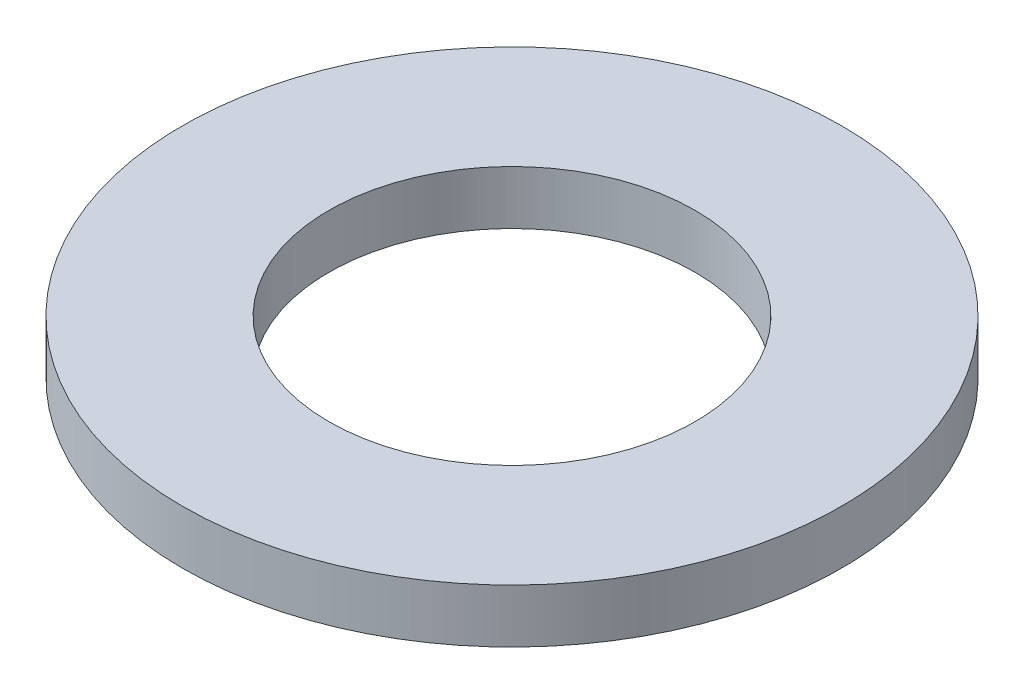
ISO-10303-21;
HEADER;
FILE_DESCRIPTION(('STEP AP214'),'2;1');
FILE_NAME('part.step','',(''),(''),'','','');
FILE_SCHEMA(('AUTOMOTIVE_DESIGN { 1 0 10303 214 1 1 1 1 }'));
ENDSEC;
DATA;
#1=APPLICATION_CONTEXT('core data for automotive mechanical design processes');
#2=APPLICATION_PROTOCOL_DEFINITION('international standard','automotive_design',2000,#1);
#3=PRODUCT_CONTEXT('',#1,'mechanical');
#4=PRODUCT('Part','Part','',(#3));
#5=PRODUCT_RELATED_PRODUCT_CATEGORY('part','',(#4));
#6=PRODUCT_DEFINITION_FORMATION('','',#4);
#7=PRODUCT_DEFINITION_CONTEXT('part definition',#1,'design');
#8=PRODUCT_DEFINITION('design','',#6,#7);
#9=PRODUCT_DEFINITION_SHAPE('','',#8);
#10=(LENGTH_UNIT() NAMED_UNIT(*) SI_UNIT(.MILLI.,.METRE.));
#11=(NAMED_UNIT(*) PLANE_ANGLE_UNIT() SI_UNIT($,.RADIAN.));
#12=(NAMED_UNIT(*) SI_UNIT($,.STERADIAN.) SOLID_ANGLE_UNIT());
#13=UNCERTAINTY_MEASURE_WITH_UNIT(LENGTH_MEASURE(1.E-05),#10,'distance_accuracy_value','');
#14=(GEOMETRIC_REPRESENTATION_CONTEXT(3) GLOBAL_UNCERTAINTY_ASSIGNED_CONTEXT((#13)) GLOBAL_UNIT_ASSIGNED_CONTEXT((#10,
#11,#12)) REPRESENTATION_CONTEXT('',''));
#15=CARTESIAN_POINT('',(0.,0.,0.));
#16=DIRECTION('',(0.,0.,1.));
#17=DIRECTION('',(1.,0.,0.));
#18=AXIS2_PLACEMENT_3D('',#15,#16,#17);
#19=CARTESIAN_POINT('',(0.,11.,0.));
#20=DIRECTION('',(0.,-1.,0.));
#21=DIRECTION('',(0.,0.,-1.));
#22=AXIS2_PLACEMENT_3D('',#19,#20,#21);
#23=CYLINDRICAL_SURFACE('',#22,67.5);
#24=CARTESIAN_POINT('',(0.,11.,0.));
#25=DIRECTION('',(0.,1.,0.));
#26=DIRECTION('',(0.,0.,1.));
#27=AXIS2_PLACEMENT_3D('',#24,#25,#26);
#28=CIRCLE('',#27,67.5);
#29=CARTESIAN_POINT('',(0.,11.,67.5));
#30=VERTEX_POINT('',#29);
#31=EDGE_CURVE('E10',#30,#30,#28,.T.);
#32=ORIENTED_EDGE('',*,*,#31,.F.);
#33=EDGE_LOOP('',(#32));
#34=FACE_BOUND('',#33,.T.);
#35=CARTESIAN_POINT('',(0.,0.,0.));
#36=DIRECTION('',(0.,1.,0.));
#37=DIRECTION('',(0.,0.,1.));
#38=AXIS2_PLACEMENT_3D('',#35,#36,#37);
#39=CIRCLE('',#38,67.5);
#40=CARTESIAN_POINT('',(0.,0.,67.5));
#41=VERTEX_POINT('',#40);
#42=EDGE_CURVE('E37',#41,#41,#39,.T.);
#43=ORIENTED_EDGE('',*,*,#42,.T.);
#44=EDGE_LOOP('',(#43));
#45=FACE_BOUND('',#44,.T.);
#46=ADVANCED_FACE('F40',(#34,#45),#23,.T.);
#47=CARTESIAN_POINT('',(0.,11.,0.));
#48=DIRECTION('',(0.,1.,0.));
#49=DIRECTION('',(0.,0.,1.));
#50=AXIS2_PLACEMENT_3D('',#47,#48,#49);
#51=PLANE('',#50);
#52=CARTESIAN_POINT('',(0.,11.,0.));
#53=DIRECTION('',(0.,1.,0.));
#54=DIRECTION('',(0.,0.,1.));
#55=AXIS2_PLACEMENT_3D('',#52,#53,#54);
#56=CIRCLE('',#55,37.5);
#57=CARTESIAN_POINT('',(0.,11.,37.5));
#58=VERTEX_POINT('',#57);
#59=EDGE_CURVE('E50',#58,#58,#56,.T.);
#60=ORIENTED_EDGE('',*,*,#59,.F.);
#61=EDGE_LOOP('',(#60));
#62=FACE_BOUND('',#61,.T.);
#63=ORIENTED_EDGE('',*,*,#31,.T.);
#64=EDGE_LOOP('',(#63));
#65=FACE_BOUND('',#64,.T.);
#66=ADVANCED_FACE('F59',(#62,#65),#51,.T.);
#67=CARTESIAN_POINT('',(0.,0.,0.));
#68=DIRECTION('',(0.,1.,0.));
#69=DIRECTION('',(0.,0.,1.));
#70=AXIS2_PLACEMENT_3D('',#67,#68,#69);
#71=PLANE('',#70);
#72=CARTESIAN_POINT('',(0.,0.,0.));
#73=DIRECTION('',(0.,1.,0.));
#74=DIRECTION('',(0.,0.,1.));
#75=AXIS2_PLACEMENT_3D('',#72,#73,#74);
#76=CIRCLE('',#75,37.5);
#77=CARTESIAN_POINT('',(0.,0.,37.5));
#78=VERTEX_POINT('',#77);
#79=EDGE_CURVE('E47',#78,#78,#76,.T.);
#80=ORIENTED_EDGE('',*,*,#79,.T.);
#81=EDGE_LOOP('',(#80));
#82=FACE_BOUND('',#81,.T.);
#83=ORIENTED_EDGE('',*,*,#42,.F.);
#84=EDGE_LOOP('',(#83));
#85=FACE_BOUND('',#84,.T.);
#86=ADVANCED_FACE('F58',(#82,#85),#71,.F.);
#87=CARTESIAN_POINT('',(0.,11.,0.));
#88=DIRECTION('',(0.,-1.,0.));
#89=DIRECTION('',(0.,0.,-1.));
#90=AXIS2_PLACEMENT_3D('',#87,#88,#89);
#91=CYLINDRICAL_SURFACE('',#90,37.5);
#92=ORIENTED_EDGE('',*,*,#59,.T.);
#93=EDGE_LOOP('',(#92));
#94=FACE_BOUND('',#93,.T.);
#95=ORIENTED_EDGE('',*,*,#79,.F.);
#96=EDGE_LOOP('',(#95));
#97=FACE_BOUND('',#96,.T.);
#98=ADVANCED_FACE('F54',(#94,#97),#91,.F.);
#99=CLOSED_SHELL('',(#46,#66,#86,#98));
#100=MANIFOLD_SOLID_BREP('B2',#99);
#101=ADVANCED_BREP_SHAPE_REPRESENTATION('',(#18,#100),#14);
#102=SHAPE_DEFINITION_REPRESENTATION(#9,#101);
ENDSEC;
END-ISO-10303-21;
